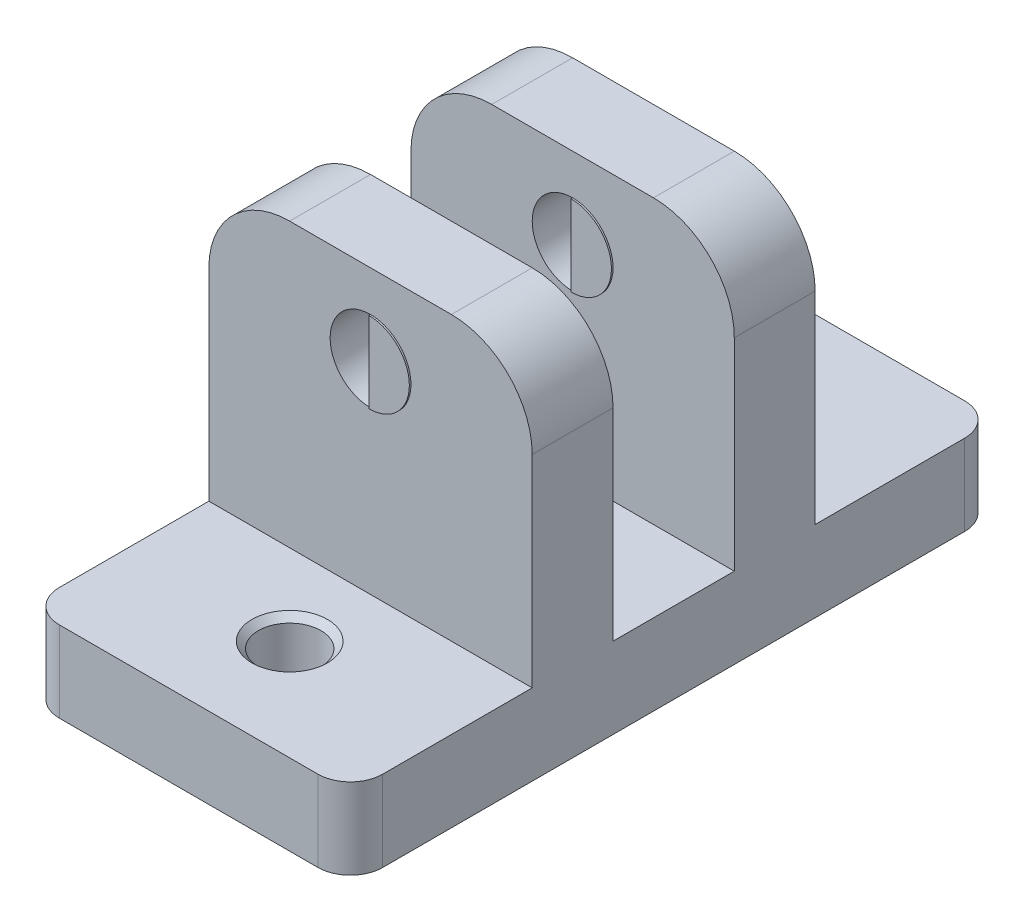
ISO-10303-21;
HEADER;
FILE_DESCRIPTION(('STEP AP214'),'2;1');
FILE_NAME('part.step','',(''),(''),'','','');
FILE_SCHEMA(('AUTOMOTIVE_DESIGN { 1 0 10303 214 1 1 1 1 }'));
ENDSEC;
DATA;
#1=APPLICATION_CONTEXT('core data for automotive mechanical design processes');
#2=APPLICATION_PROTOCOL_DEFINITION('international standard','automotive_design',2000,#1);
#3=PRODUCT_CONTEXT('',#1,'mechanical');
#4=PRODUCT('Part','Part','',(#3));
#5=PRODUCT_RELATED_PRODUCT_CATEGORY('part','',(#4));
#6=PRODUCT_DEFINITION_FORMATION('','',#4);
#7=PRODUCT_DEFINITION_CONTEXT('part definition',#1,'design');
#8=PRODUCT_DEFINITION('design','',#6,#7);
#9=PRODUCT_DEFINITION_SHAPE('','',#8);
#10=(LENGTH_UNIT() NAMED_UNIT(*) SI_UNIT(.MILLI.,.METRE.));
#11=(NAMED_UNIT(*) PLANE_ANGLE_UNIT() SI_UNIT($,.RADIAN.));
#12=(NAMED_UNIT(*) SI_UNIT($,.STERADIAN.) SOLID_ANGLE_UNIT());
#13=UNCERTAINTY_MEASURE_WITH_UNIT(LENGTH_MEASURE(1.E-05),#10,'distance_accuracy_value','');
#14=(GEOMETRIC_REPRESENTATION_CONTEXT(3) GLOBAL_UNCERTAINTY_ASSIGNED_CONTEXT((#13)) GLOBAL_UNIT_ASSIGNED_CONTEXT((#10,
#11,#12)) REPRESENTATION_CONTEXT('',''));
#15=CARTESIAN_POINT('',(0.,0.,0.));
#16=DIRECTION('',(0.,0.,1.));
#17=DIRECTION('',(1.,0.,0.));
#18=AXIS2_PLACEMENT_3D('',#15,#16,#17);
#19=CARTESIAN_POINT('',(0.,22.225,25.4));
#20=DIRECTION('',(0.,0.,-1.));
#21=DIRECTION('',(0.,1.,0.));
#22=AXIS2_PLACEMENT_3D('',#19,#20,#21);
#23=CYLINDRICAL_SURFACE('',#22,3.175);
#24=DIRECTION('',(0.,0.,-1.));
#25=VECTOR('',#24,1.);
#26=CARTESIAN_POINT('',(0.,19.05,25.4));
#27=LINE('',#26,#25);
#28=CARTESIAN_POINT('',(0.,19.05,4.7625));
#29=VERTEX_POINT('',#28);
#30=CARTESIAN_POINT('',(0.,19.05,11.1125));
#31=VERTEX_POINT('',#30);
#32=EDGE_CURVE('E12',#29,#31,#27,.F.);
#33=ORIENTED_EDGE('',*,*,#32,.F.);
#34=CARTESIAN_POINT('',(0.,22.225,4.7625));
#35=DIRECTION('',(0.,0.,1.));
#36=DIRECTION('',(0.,-1.,0.));
#37=AXIS2_PLACEMENT_3D('',#34,#35,#36);
#38=CIRCLE('',#37,3.175);
#39=CARTESIAN_POINT('',(0.,25.4,4.7625));
#40=VERTEX_POINT('',#39);
#41=EDGE_CURVE('E304',#40,#29,#38,.T.);
#42=ORIENTED_EDGE('',*,*,#41,.F.);
#43=DIRECTION('',(0.,0.,-1.));
#44=VECTOR('',#43,1.);
#45=CARTESIAN_POINT('',(0.,25.4,25.4));
#46=LINE('',#45,#44);
#47=CARTESIAN_POINT('',(0.,25.4,11.1125));
#48=VERTEX_POINT('',#47);
#49=EDGE_CURVE('E58',#48,#40,#46,.T.);
#50=ORIENTED_EDGE('',*,*,#49,.F.);
#51=CARTESIAN_POINT('',(0.,22.225,11.1125));
#52=DIRECTION('',(0.,0.,-1.));
#53=DIRECTION('',(0.,1.,0.));
#54=AXIS2_PLACEMENT_3D('',#51,#52,#53);
#55=CIRCLE('',#54,3.175);
#56=EDGE_CURVE('E65',#31,#48,#55,.T.);
#57=ORIENTED_EDGE('',*,*,#56,.F.);
#58=EDGE_LOOP('',(#33,#42,#50,#57));
#59=FACE_BOUND('',#58,.T.);
#60=ADVANCED_FACE('F50',(#59),#23,.F.);
#61=CARTESIAN_POINT('',(0.,28.575,0.));
#62=DIRECTION('',(0.,-1.,0.));
#63=DIRECTION('',(0.,0.,-1.));
#64=AXIS2_PLACEMENT_3D('',#61,#62,#63);
#65=PLANE('',#64);
#66=DIRECTION('',(1.,0.,0.));
#67=VECTOR('',#66,1.);
#68=CARTESIAN_POINT('',(-12.7,28.575,11.1125));
#69=LINE('',#68,#67);
#70=CARTESIAN_POINT('',(-6.35,28.575,11.1125));
#71=VERTEX_POINT('',#70);
#72=CARTESIAN_POINT('',(6.35,28.575,11.1125));
#73=VERTEX_POINT('',#72);
#74=EDGE_CURVE('E360',#71,#73,#69,.T.);
#75=ORIENTED_EDGE('',*,*,#74,.T.);
#76=DIRECTION('',(0.,0.,-1.));
#77=VECTOR('',#76,1.);
#78=CARTESIAN_POINT('',(6.35,28.575,0.));
#79=LINE('',#78,#77);
#80=CARTESIAN_POINT('',(6.35,28.575,4.7625));
#81=VERTEX_POINT('',#80);
#82=EDGE_CURVE('E388',#73,#81,#79,.T.);
#83=ORIENTED_EDGE('',*,*,#82,.T.);
#84=DIRECTION('',(1.,0.,0.));
#85=VECTOR('',#84,1.);
#86=CARTESIAN_POINT('',(-12.7,28.575,4.7625));
#87=LINE('',#86,#85);
#88=CARTESIAN_POINT('',(-6.35,28.575,4.7625));
#89=VERTEX_POINT('',#88);
#90=EDGE_CURVE('E318',#89,#81,#87,.T.);
#91=ORIENTED_EDGE('',*,*,#90,.F.);
#92=DIRECTION('',(0.,0.,1.));
#93=VECTOR('',#92,1.);
#94=CARTESIAN_POINT('',(-6.35,28.575,0.));
#95=LINE('',#94,#93);
#96=EDGE_CURVE('E385',#89,#71,#95,.T.);
#97=ORIENTED_EDGE('',*,*,#96,.T.);
#98=EDGE_LOOP('',(#75,#83,#91,#97));
#99=FACE_BOUND('',#98,.T.);
#100=ADVANCED_FACE('F596',(#99),#65,.F.);
#101=CARTESIAN_POINT('',(12.7,28.575,25.4));
#102=DIRECTION('',(-1.,0.,0.));
#103=DIRECTION('',(0.,0.,1.));
#104=AXIS2_PLACEMENT_3D('',#101,#102,#103);
#105=PLANE('',#104);
#106=DIRECTION('',(0.,0.,-1.));
#107=VECTOR('',#106,1.);
#108=CARTESIAN_POINT('',(12.7,6.35,25.4));
#109=LINE('',#108,#107);
#110=CARTESIAN_POINT('',(12.7,6.35,22.86));
#111=VERTEX_POINT('',#110);
#112=CARTESIAN_POINT('',(12.7,6.35,11.1125));
#113=VERTEX_POINT('',#112);
#114=EDGE_CURVE('E324',#111,#113,#109,.T.);
#115=ORIENTED_EDGE('',*,*,#114,.F.);
#116=DIRECTION('',(0.,-1.,0.));
#117=VECTOR('',#116,1.);
#118=CARTESIAN_POINT('',(12.7,28.575,22.86));
#119=LINE('',#118,#117);
#120=CARTESIAN_POINT('',(12.7,0.,22.86));
#121=VERTEX_POINT('',#120);
#122=EDGE_CURVE('E425',#111,#121,#119,.T.);
#123=ORIENTED_EDGE('',*,*,#122,.T.);
#124=DIRECTION('',(0.,0.,-1.));
#125=VECTOR('',#124,1.);
#126=CARTESIAN_POINT('',(12.7,0.,25.4));
#127=LINE('',#126,#125);
#128=CARTESIAN_POINT('',(12.7,0.,-22.86));
#129=VERTEX_POINT('',#128);
#130=EDGE_CURVE('E363',#121,#129,#127,.T.);
#131=ORIENTED_EDGE('',*,*,#130,.T.);
#132=DIRECTION('',(0.,-1.,0.));
#133=VECTOR('',#132,1.);
#134=CARTESIAN_POINT('',(12.7,28.575,-22.86));
#135=LINE('',#134,#133);
#136=CARTESIAN_POINT('',(12.7,6.35,-22.86));
#137=VERTEX_POINT('',#136);
#138=EDGE_CURVE('E423',#129,#137,#135,.F.);
#139=ORIENTED_EDGE('',*,*,#138,.T.);
#140=DIRECTION('',(0.,0.,-1.));
#141=VECTOR('',#140,1.);
#142=CARTESIAN_POINT('',(12.7,6.35,-25.4));
#143=LINE('',#142,#141);
#144=CARTESIAN_POINT('',(12.7,6.35,-11.1125));
#145=VERTEX_POINT('',#144);
#146=EDGE_CURVE('E312',#145,#137,#143,.T.);
#147=ORIENTED_EDGE('',*,*,#146,.F.);
#148=DIRECTION('',(0.,-1.,0.));
#149=VECTOR('',#148,1.);
#150=CARTESIAN_POINT('',(12.7,28.575,-11.1125));
#151=LINE('',#150,#149);
#152=CARTESIAN_POINT('',(12.7,22.225,-11.1125));
#153=VERTEX_POINT('',#152);
#154=EDGE_CURVE('E316',#153,#145,#151,.T.);
#155=ORIENTED_EDGE('',*,*,#154,.F.);
#156=DIRECTION('',(0.,0.,-1.));
#157=VECTOR('',#156,1.);
#158=CARTESIAN_POINT('',(12.7,22.225,25.4));
#159=LINE('',#158,#157);
#160=CARTESIAN_POINT('',(12.7,22.225,-4.7625));
#161=VERTEX_POINT('',#160);
#162=EDGE_CURVE('E395',#153,#161,#159,.F.);
#163=ORIENTED_EDGE('',*,*,#162,.T.);
#164=DIRECTION('',(0.,1.,0.));
#165=VECTOR('',#164,1.);
#166=CARTESIAN_POINT('',(12.7,28.575,-4.7625));
#167=LINE('',#166,#165);
#168=CARTESIAN_POINT('',(12.7,6.35,-4.7625));
#169=VERTEX_POINT('',#168);
#170=EDGE_CURVE('E522',#169,#161,#167,.T.);
#171=ORIENTED_EDGE('',*,*,#170,.F.);
#172=DIRECTION('',(0.,0.,-1.));
#173=VECTOR('',#172,1.);
#174=CARTESIAN_POINT('',(12.7,6.35,4.76249999999999));
#175=LINE('',#174,#173);
#176=CARTESIAN_POINT('',(12.7,6.35,4.76249999999999));
#177=VERTEX_POINT('',#176);
#178=EDGE_CURVE('E526',#177,#169,#175,.T.);
#179=ORIENTED_EDGE('',*,*,#178,.F.);
#180=DIRECTION('',(0.,-1.,0.));
#181=VECTOR('',#180,1.);
#182=CARTESIAN_POINT('',(12.7,28.575,4.7625));
#183=LINE('',#182,#181);
#184=CARTESIAN_POINT('',(12.7,22.225,4.7625));
#185=VERTEX_POINT('',#184);
#186=EDGE_CURVE('E308',#185,#177,#183,.T.);
#187=ORIENTED_EDGE('',*,*,#186,.F.);
#188=DIRECTION('',(0.,0.,-1.));
#189=VECTOR('',#188,1.);
#190=CARTESIAN_POINT('',(12.7,22.225,25.4));
#191=LINE('',#190,#189);
#192=CARTESIAN_POINT('',(12.7,22.225,11.1125));
#193=VERTEX_POINT('',#192);
#194=EDGE_CURVE('E397',#185,#193,#191,.F.);
#195=ORIENTED_EDGE('',*,*,#194,.T.);
#196=DIRECTION('',(0.,1.,0.));
#197=VECTOR('',#196,1.);
#198=CARTESIAN_POINT('',(12.7,28.575,11.1125));
#199=LINE('',#198,#197);
#200=EDGE_CURVE('E352',#113,#193,#199,.T.);
#201=ORIENTED_EDGE('',*,*,#200,.F.);
#202=EDGE_LOOP('',(#115,#123,#131,#139,#147,#155,#163,#171,#179,#187,#195,#201));
#203=FACE_BOUND('',#202,.T.);
#204=ADVANCED_FACE('F601',(#203),#105,.F.);
#205=CARTESIAN_POINT('',(-12.7,28.575,-25.4));
#206=DIRECTION('',(0.,0.,1.));
#207=DIRECTION('',(1.,0.,0.));
#208=AXIS2_PLACEMENT_3D('',#205,#206,#207);
#209=PLANE('',#208);
#210=DIRECTION('',(1.,0.,0.));
#211=VECTOR('',#210,1.);
#212=CARTESIAN_POINT('',(-12.7,6.35,-25.4));
#213=LINE('',#212,#211);
#214=CARTESIAN_POINT('',(-10.16,6.35,-25.4));
#215=VERTEX_POINT('',#214);
#216=CARTESIAN_POINT('',(10.16,6.35,-25.4));
#217=VERTEX_POINT('',#216);
#218=EDGE_CURVE('E321',#215,#217,#213,.T.);
#219=ORIENTED_EDGE('',*,*,#218,.T.);
#220=DIRECTION('',(0.,-1.,0.));
#221=VECTOR('',#220,1.);
#222=CARTESIAN_POINT('',(10.16,28.575,-25.4));
#223=LINE('',#222,#221);
#224=CARTESIAN_POINT('',(10.16,0.,-25.4));
#225=VERTEX_POINT('',#224);
#226=EDGE_CURVE('E450',#217,#225,#223,.T.);
#227=ORIENTED_EDGE('',*,*,#226,.T.);
#228=DIRECTION('',(-1.,0.,0.));
#229=VECTOR('',#228,1.);
#230=CARTESIAN_POINT('',(-12.7,0.,-25.4));
#231=LINE('',#230,#229);
#232=CARTESIAN_POINT('',(-10.16,0.,-25.4));
#233=VERTEX_POINT('',#232);
#234=EDGE_CURVE('E374',#225,#233,#231,.T.);
#235=ORIENTED_EDGE('',*,*,#234,.T.);
#236=DIRECTION('',(0.,-1.,0.));
#237=VECTOR('',#236,1.);
#238=CARTESIAN_POINT('',(-10.16,28.575,-25.4));
#239=LINE('',#238,#237);
#240=EDGE_CURVE('E448',#233,#215,#239,.F.);
#241=ORIENTED_EDGE('',*,*,#240,.T.);
#242=EDGE_LOOP('',(#219,#227,#235,#241));
#243=FACE_BOUND('',#242,.T.);
#244=ADVANCED_FACE('F653',(#243),#209,.F.);
#245=CARTESIAN_POINT('',(-12.7,28.575,25.4));
#246=DIRECTION('',(1.,0.,0.));
#247=DIRECTION('',(0.,0.,-1.));
#248=AXIS2_PLACEMENT_3D('',#245,#246,#247);
#249=PLANE('',#248);
#250=DIRECTION('',(0.,0.,1.));
#251=VECTOR('',#250,1.);
#252=CARTESIAN_POINT('',(-12.7,0.,25.4));
#253=LINE('',#252,#251);
#254=CARTESIAN_POINT('',(-12.7,0.,-22.86));
#255=VERTEX_POINT('',#254);
#256=CARTESIAN_POINT('',(-12.7,0.,22.86));
#257=VERTEX_POINT('',#256);
#258=EDGE_CURVE('E377',#255,#257,#253,.T.);
#259=ORIENTED_EDGE('',*,*,#258,.T.);
#260=DIRECTION('',(0.,-1.,0.));
#261=VECTOR('',#260,1.);
#262=CARTESIAN_POINT('',(-12.7,28.575,22.86));
#263=LINE('',#262,#261);
#264=CARTESIAN_POINT('',(-12.7,6.35,22.86));
#265=VERTEX_POINT('',#264);
#266=EDGE_CURVE('E460',#257,#265,#263,.F.);
#267=ORIENTED_EDGE('',*,*,#266,.T.);
#268=DIRECTION('',(0.,0.,-1.));
#269=VECTOR('',#268,1.);
#270=CARTESIAN_POINT('',(-12.7,6.35,25.4));
#271=LINE('',#270,#269);
#272=CARTESIAN_POINT('',(-12.7,6.35,11.1125));
#273=VERTEX_POINT('',#272);
#274=EDGE_CURVE('E348',#265,#273,#271,.T.);
#275=ORIENTED_EDGE('',*,*,#274,.T.);
#276=DIRECTION('',(0.,1.,0.));
#277=VECTOR('',#276,1.);
#278=CARTESIAN_POINT('',(-12.7,28.575,11.1125));
#279=LINE('',#278,#277);
#280=CARTESIAN_POINT('',(-12.7,22.225,11.1125));
#281=VERTEX_POINT('',#280);
#282=EDGE_CURVE('E351',#273,#281,#279,.T.);
#283=ORIENTED_EDGE('',*,*,#282,.T.);
#284=DIRECTION('',(0.,0.,1.));
#285=VECTOR('',#284,1.);
#286=CARTESIAN_POINT('',(-12.7,22.225,25.4));
#287=LINE('',#286,#285);
#288=CARTESIAN_POINT('',(-12.7,22.225,4.7625));
#289=VERTEX_POINT('',#288);
#290=EDGE_CURVE('E419',#281,#289,#287,.F.);
#291=ORIENTED_EDGE('',*,*,#290,.T.);
#292=DIRECTION('',(0.,-1.,0.));
#293=VECTOR('',#292,1.);
#294=CARTESIAN_POINT('',(-12.7,28.575,4.7625));
#295=LINE('',#294,#293);
#296=CARTESIAN_POINT('',(-12.7,6.35,4.76249999999999));
#297=VERTEX_POINT('',#296);
#298=EDGE_CURVE('E525',#289,#297,#295,.T.);
#299=ORIENTED_EDGE('',*,*,#298,.T.);
#300=DIRECTION('',(0.,0.,-1.));
#301=VECTOR('',#300,1.);
#302=CARTESIAN_POINT('',(-12.7,6.35,4.76249999999999));
#303=LINE('',#302,#301);
#304=CARTESIAN_POINT('',(-12.7,6.35,-4.7625));
#305=VERTEX_POINT('',#304);
#306=EDGE_CURVE('E533',#297,#305,#303,.T.);
#307=ORIENTED_EDGE('',*,*,#306,.T.);
#308=DIRECTION('',(0.,1.,0.));
#309=VECTOR('',#308,1.);
#310=CARTESIAN_POINT('',(-12.7,28.575,-4.7625));
#311=LINE('',#310,#309);
#312=CARTESIAN_POINT('',(-12.7,22.225,-4.7625));
#313=VERTEX_POINT('',#312);
#314=EDGE_CURVE('E347',#305,#313,#311,.T.);
#315=ORIENTED_EDGE('',*,*,#314,.T.);
#316=DIRECTION('',(0.,0.,1.));
#317=VECTOR('',#316,1.);
#318=CARTESIAN_POINT('',(-12.7,22.225,25.4));
#319=LINE('',#318,#317);
#320=CARTESIAN_POINT('',(-12.7,22.225,-11.1125));
#321=VERTEX_POINT('',#320);
#322=EDGE_CURVE('E421',#313,#321,#319,.F.);
#323=ORIENTED_EDGE('',*,*,#322,.T.);
#324=DIRECTION('',(0.,-1.,0.));
#325=VECTOR('',#324,1.);
#326=CARTESIAN_POINT('',(-12.7,28.575,-11.1125));
#327=LINE('',#326,#325);
#328=CARTESIAN_POINT('',(-12.7,6.35,-11.1125));
#329=VERTEX_POINT('',#328);
#330=EDGE_CURVE('E309',#321,#329,#327,.T.);
#331=ORIENTED_EDGE('',*,*,#330,.T.);
#332=DIRECTION('',(0.,0.,-1.));
#333=VECTOR('',#332,1.);
#334=CARTESIAN_POINT('',(-12.7,6.35,-25.4));
#335=LINE('',#334,#333);
#336=CARTESIAN_POINT('',(-12.7,6.35,-22.86));
#337=VERTEX_POINT('',#336);
#338=EDGE_CURVE('E311',#329,#337,#335,.T.);
#339=ORIENTED_EDGE('',*,*,#338,.T.);
#340=DIRECTION('',(0.,-1.,0.));
#341=VECTOR('',#340,1.);
#342=CARTESIAN_POINT('',(-12.7,28.575,-22.86));
#343=LINE('',#342,#341);
#344=EDGE_CURVE('E457',#337,#255,#343,.T.);
#345=ORIENTED_EDGE('',*,*,#344,.T.);
#346=EDGE_LOOP('',(#259,#267,#275,#283,#291,#299,#307,#315,#323,#331,#339,#345));
#347=FACE_BOUND('',#346,.T.);
#348=ADVANCED_FACE('F538',(#347),#249,.F.);
#349=CARTESIAN_POINT('',(-12.7,28.575,25.4));
#350=DIRECTION('',(0.,0.,-1.));
#351=DIRECTION('',(-1.,0.,0.));
#352=AXIS2_PLACEMENT_3D('',#349,#350,#351);
#353=PLANE('',#352);
#354=DIRECTION('',(1.,0.,0.));
#355=VECTOR('',#354,1.);
#356=CARTESIAN_POINT('',(-12.7,0.,25.4));
#357=LINE('',#356,#355);
#358=CARTESIAN_POINT('',(-10.16,0.,25.4));
#359=VERTEX_POINT('',#358);
#360=CARTESIAN_POINT('',(10.16,0.,25.4));
#361=VERTEX_POINT('',#360);
#362=EDGE_CURVE('E380',#359,#361,#357,.T.);
#363=ORIENTED_EDGE('',*,*,#362,.T.);
#364=DIRECTION('',(0.,-1.,0.));
#365=VECTOR('',#364,1.);
#366=CARTESIAN_POINT('',(10.16,28.575,25.4));
#367=LINE('',#366,#365);
#368=CARTESIAN_POINT('',(10.16,6.35,25.4));
#369=VERTEX_POINT('',#368);
#370=EDGE_CURVE('E441',#361,#369,#367,.F.);
#371=ORIENTED_EDGE('',*,*,#370,.T.);
#372=DIRECTION('',(1.,0.,0.));
#373=VECTOR('',#372,1.);
#374=CARTESIAN_POINT('',(-12.7,6.35,25.4));
#375=LINE('',#374,#373);
#376=CARTESIAN_POINT('',(-10.16,6.35,25.4));
#377=VERTEX_POINT('',#376);
#378=EDGE_CURVE('E356',#377,#369,#375,.T.);
#379=ORIENTED_EDGE('',*,*,#378,.F.);
#380=DIRECTION('',(0.,-1.,0.));
#381=VECTOR('',#380,1.);
#382=CARTESIAN_POINT('',(-10.16,28.575,25.4));
#383=LINE('',#382,#381);
#384=EDGE_CURVE('E437',#377,#359,#383,.T.);
#385=ORIENTED_EDGE('',*,*,#384,.T.);
#386=EDGE_LOOP('',(#363,#371,#379,#385));
#387=FACE_BOUND('',#386,.T.);
#388=ADVANCED_FACE('F644',(#387),#353,.F.);
#389=DIRECTION('',(1.,0.,0.));
#390=VECTOR('',#389,1.);
#391=CARTESIAN_POINT('',(-12.7,28.575,-4.7625));
#392=LINE('',#391,#390);
#393=CARTESIAN_POINT('',(-6.35,28.575,-4.7625));
#394=VERTEX_POINT('',#393);
#395=CARTESIAN_POINT('',(6.35,28.575,-4.7625));
#396=VERTEX_POINT('',#395);
#397=EDGE_CURVE('E340',#394,#396,#392,.T.);
#398=ORIENTED_EDGE('',*,*,#397,.T.);
#399=DIRECTION('',(0.,0.,-1.));
#400=VECTOR('',#399,1.);
#401=CARTESIAN_POINT('',(6.35,28.575,0.));
#402=LINE('',#401,#400);
#403=CARTESIAN_POINT('',(6.35,28.575,-11.1125));
#404=VERTEX_POINT('',#403);
#405=EDGE_CURVE('E407',#396,#404,#402,.T.);
#406=ORIENTED_EDGE('',*,*,#405,.T.);
#407=DIRECTION('',(1.,0.,0.));
#408=VECTOR('',#407,1.);
#409=CARTESIAN_POINT('',(-12.7,28.575,-11.1125));
#410=LINE('',#409,#408);
#411=CARTESIAN_POINT('',(-6.35,28.575,-11.1125));
#412=VERTEX_POINT('',#411);
#413=EDGE_CURVE('E315',#412,#404,#410,.T.);
#414=ORIENTED_EDGE('',*,*,#413,.F.);
#415=DIRECTION('',(0.,0.,1.));
#416=VECTOR('',#415,1.);
#417=CARTESIAN_POINT('',(-6.35,28.575,0.));
#418=LINE('',#417,#416);
#419=EDGE_CURVE('E404',#412,#394,#418,.T.);
#420=ORIENTED_EDGE('',*,*,#419,.T.);
#421=EDGE_LOOP('',(#398,#406,#414,#420));
#422=FACE_BOUND('',#421,.T.);
#423=ADVANCED_FACE('F560',(#422),#65,.F.);
#424=CARTESIAN_POINT('',(0.,0.,0.));
#425=DIRECTION('',(0.,-1.,0.));
#426=DIRECTION('',(0.,0.,-1.));
#427=AXIS2_PLACEMENT_3D('',#424,#425,#426);
#428=PLANE('',#427);
#429=CARTESIAN_POINT('',(0.,0.,-17.4625));
#430=DIRECTION('',(0.,-1.,0.));
#431=DIRECTION('',(0.,0.,-1.));
#432=AXIS2_PLACEMENT_3D('',#429,#430,#431);
#433=CIRCLE('',#432,2.96545000000001);
#434=CARTESIAN_POINT('',(0.,0.,-20.42795));
#435=VERTEX_POINT('',#434);
#436=EDGE_CURVE('E476',#435,#435,#433,.F.);
#437=ORIENTED_EDGE('',*,*,#436,.T.);
#438=EDGE_LOOP('',(#437));
#439=FACE_BOUND('',#438,.T.);
#440=CARTESIAN_POINT('',(0.,0.,17.4625));
#441=DIRECTION('',(0.,-1.,0.));
#442=DIRECTION('',(0.,0.,-1.));
#443=AXIS2_PLACEMENT_3D('',#440,#441,#442);
#444=CIRCLE('',#443,2.96544999999999);
#445=CARTESIAN_POINT('',(0.,0.,14.49705));
#446=VERTEX_POINT('',#445);
#447=EDGE_CURVE('E472',#446,#446,#444,.F.);
#448=ORIENTED_EDGE('',*,*,#447,.T.);
#449=EDGE_LOOP('',(#448));
#450=FACE_BOUND('',#449,.T.);
#451=ORIENTED_EDGE('',*,*,#130,.F.);
#452=CARTESIAN_POINT('',(10.16,0.,22.86));
#453=DIRECTION('',(0.,-1.,0.));
#454=DIRECTION('',(0.,0.,-1.));
#455=AXIS2_PLACEMENT_3D('',#452,#453,#454);
#456=CIRCLE('',#455,2.54);
#457=EDGE_CURVE('E435',#121,#361,#456,.T.);
#458=ORIENTED_EDGE('',*,*,#457,.T.);
#459=ORIENTED_EDGE('',*,*,#362,.F.);
#460=CARTESIAN_POINT('',(-10.16,0.,22.86));
#461=DIRECTION('',(0.,-1.,0.));
#462=DIRECTION('',(0.,0.,-1.));
#463=AXIS2_PLACEMENT_3D('',#460,#461,#462);
#464=CIRCLE('',#463,2.54);
#465=EDGE_CURVE('E430',#359,#257,#464,.T.);
#466=ORIENTED_EDGE('',*,*,#465,.T.);
#467=ORIENTED_EDGE('',*,*,#258,.F.);
#468=CARTESIAN_POINT('',(-10.16,0.,-22.86));
#469=DIRECTION('',(0.,-1.,0.));
#470=DIRECTION('',(0.,0.,-1.));
#471=AXIS2_PLACEMENT_3D('',#468,#469,#470);
#472=CIRCLE('',#471,2.54);
#473=EDGE_CURVE('E428',#255,#233,#472,.T.);
#474=ORIENTED_EDGE('',*,*,#473,.T.);
#475=ORIENTED_EDGE('',*,*,#234,.F.);
#476=CARTESIAN_POINT('',(10.16,0.,-22.86));
#477=DIRECTION('',(0.,-1.,0.));
#478=DIRECTION('',(0.,0.,-1.));
#479=AXIS2_PLACEMENT_3D('',#476,#477,#478);
#480=CIRCLE('',#479,2.54);
#481=EDGE_CURVE('E433',#225,#129,#480,.T.);
#482=ORIENTED_EDGE('',*,*,#481,.T.);
#483=EDGE_LOOP('',(#451,#458,#459,#466,#467,#474,#475,#482));
#484=FACE_BOUND('',#483,.T.);
#485=ADVANCED_FACE('F638',(#439,#450,#484),#428,.T.);
#486=CARTESIAN_POINT('',(-12.7,28.575,11.1125));
#487=DIRECTION('',(0.,0.,-1.));
#488=DIRECTION('',(0.,1.,0.));
#489=AXIS2_PLACEMENT_3D('',#486,#487,#488);
#490=PLANE('',#489);
#491=EDGE_CURVE('E247',#48,#31,#55,.T.);
#492=ORIENTED_EDGE('',*,*,#491,.T.);
#493=ORIENTED_EDGE('',*,*,#56,.T.);
#494=EDGE_LOOP('',(#492,#493));
#495=FACE_BOUND('',#494,.T.);
#496=ORIENTED_EDGE('',*,*,#200,.T.);
#497=CARTESIAN_POINT('',(6.35,22.225,11.1125));
#498=DIRECTION('',(0.,0.,-1.));
#499=DIRECTION('',(0.,1.,0.));
#500=AXIS2_PLACEMENT_3D('',#497,#498,#499);
#501=CIRCLE('',#500,6.35);
#502=EDGE_CURVE('E401',#193,#73,#501,.F.);
#503=ORIENTED_EDGE('',*,*,#502,.T.);
#504=ORIENTED_EDGE('',*,*,#74,.F.);
#505=CARTESIAN_POINT('',(-6.35,22.225,11.1125));
#506=DIRECTION('',(0.,0.,-1.));
#507=DIRECTION('',(0.,1.,0.));
#508=AXIS2_PLACEMENT_3D('',#505,#506,#507);
#509=CIRCLE('',#508,6.35);
#510=EDGE_CURVE('E399',#71,#281,#509,.F.);
#511=ORIENTED_EDGE('',*,*,#510,.T.);
#512=ORIENTED_EDGE('',*,*,#282,.F.);
#513=DIRECTION('',(1.,0.,0.));
#514=VECTOR('',#513,1.);
#515=CARTESIAN_POINT('',(-12.7,6.35,11.1125));
#516=LINE('',#515,#514);
#517=EDGE_CURVE('E364',#273,#113,#516,.T.);
#518=ORIENTED_EDGE('',*,*,#517,.T.);
#519=EDGE_LOOP('',(#496,#503,#504,#511,#512,#518));
#520=FACE_BOUND('',#519,.T.);
#521=ADVANCED_FACE('F635',(#495,#520),#490,.F.);
#522=CARTESIAN_POINT('',(-12.7,6.35,25.4));
#523=DIRECTION('',(0.,-1.,0.));
#524=DIRECTION('',(0.,0.,-1.));
#525=AXIS2_PLACEMENT_3D('',#522,#523,#524);
#526=PLANE('',#525);
#527=CARTESIAN_POINT('',(0.,6.35,17.4625));
#528=DIRECTION('',(0.,-1.,0.));
#529=DIRECTION('',(0.,0.,-1.));
#530=AXIS2_PLACEMENT_3D('',#527,#528,#529);
#531=CIRCLE('',#530,2.96545000000001);
#532=CARTESIAN_POINT('',(0.,6.35,14.49705));
#533=VERTEX_POINT('',#532);
#534=EDGE_CURVE('E487',#533,#533,#531,.T.);
#535=ORIENTED_EDGE('',*,*,#534,.T.);
#536=EDGE_LOOP('',(#535));
#537=FACE_BOUND('',#536,.T.);
#538=ORIENTED_EDGE('',*,*,#378,.T.);
#539=CARTESIAN_POINT('',(10.16,6.35,22.86));
#540=DIRECTION('',(0.,-1.,0.));
#541=DIRECTION('',(0.,0.,-1.));
#542=AXIS2_PLACEMENT_3D('',#539,#540,#541);
#543=CIRCLE('',#542,2.54);
#544=EDGE_CURVE('E446',#369,#111,#543,.F.);
#545=ORIENTED_EDGE('',*,*,#544,.T.);
#546=ORIENTED_EDGE('',*,*,#114,.T.);
#547=ORIENTED_EDGE('',*,*,#517,.F.);
#548=ORIENTED_EDGE('',*,*,#274,.F.);
#549=CARTESIAN_POINT('',(-10.16,6.35,22.86));
#550=DIRECTION('',(0.,-1.,0.));
#551=DIRECTION('',(0.,0.,-1.));
#552=AXIS2_PLACEMENT_3D('',#549,#550,#551);
#553=CIRCLE('',#552,2.54);
#554=EDGE_CURVE('E443',#265,#377,#553,.F.);
#555=ORIENTED_EDGE('',*,*,#554,.T.);
#556=EDGE_LOOP('',(#538,#545,#546,#547,#548,#555));
#557=FACE_BOUND('',#556,.T.);
#558=ADVANCED_FACE('F511',(#537,#557),#526,.F.);
#559=CARTESIAN_POINT('',(-12.7,28.575,4.7625));
#560=DIRECTION('',(0.,0.,1.));
#561=DIRECTION('',(0.,-1.,0.));
#562=AXIS2_PLACEMENT_3D('',#559,#560,#561);
#563=PLANE('',#562);
#564=EDGE_CURVE('E305',#29,#40,#38,.T.);
#565=ORIENTED_EDGE('',*,*,#564,.T.);
#566=ORIENTED_EDGE('',*,*,#41,.T.);
#567=EDGE_LOOP('',(#565,#566));
#568=FACE_BOUND('',#567,.T.);
#569=ORIENTED_EDGE('',*,*,#90,.T.);
#570=CARTESIAN_POINT('',(6.35,22.225,4.7625));
#571=DIRECTION('',(0.,0.,1.));
#572=DIRECTION('',(0.,-1.,0.));
#573=AXIS2_PLACEMENT_3D('',#570,#571,#572);
#574=CIRCLE('',#573,6.35);
#575=EDGE_CURVE('E393',#81,#185,#574,.F.);
#576=ORIENTED_EDGE('',*,*,#575,.T.);
#577=ORIENTED_EDGE('',*,*,#186,.T.);
#578=DIRECTION('',(1.,0.,0.));
#579=VECTOR('',#578,1.);
#580=CARTESIAN_POINT('',(-12.7,6.35,4.76249999999999));
#581=LINE('',#580,#579);
#582=EDGE_CURVE('E341',#297,#177,#581,.T.);
#583=ORIENTED_EDGE('',*,*,#582,.F.);
#584=ORIENTED_EDGE('',*,*,#298,.F.);
#585=CARTESIAN_POINT('',(-6.35,22.225,4.7625));
#586=DIRECTION('',(0.,0.,1.));
#587=DIRECTION('',(0.,-1.,0.));
#588=AXIS2_PLACEMENT_3D('',#585,#586,#587);
#589=CIRCLE('',#588,6.35);
#590=EDGE_CURVE('E391',#289,#89,#589,.F.);
#591=ORIENTED_EDGE('',*,*,#590,.T.);
#592=EDGE_LOOP('',(#569,#576,#577,#583,#584,#591));
#593=FACE_BOUND('',#592,.T.);
#594=ADVANCED_FACE('F507',(#568,#593),#563,.F.);
#595=CARTESIAN_POINT('',(-12.7,28.575,-4.7625));
#596=DIRECTION('',(0.,0.,-1.));
#597=DIRECTION('',(0.,1.,0.));
#598=AXIS2_PLACEMENT_3D('',#595,#596,#597);
#599=PLANE('',#598);
#600=CARTESIAN_POINT('',(0.,22.225,-4.7625));
#601=DIRECTION('',(0.,0.,-1.));
#602=DIRECTION('',(0.,1.,0.));
#603=AXIS2_PLACEMENT_3D('',#600,#601,#602);
#604=CIRCLE('',#603,3.175);
#605=CARTESIAN_POINT('',(0.,25.4,-4.7625));
#606=VERTEX_POINT('',#605);
#607=CARTESIAN_POINT('',(0.,19.05,-4.7625));
#608=VERTEX_POINT('',#607);
#609=EDGE_CURVE('E300',#606,#608,#604,.T.);
#610=ORIENTED_EDGE('',*,*,#609,.T.);
#611=EDGE_CURVE('E299',#608,#606,#604,.T.);
#612=ORIENTED_EDGE('',*,*,#611,.T.);
#613=EDGE_LOOP('',(#610,#612));
#614=FACE_BOUND('',#613,.T.);
#615=ORIENTED_EDGE('',*,*,#170,.T.);
#616=CARTESIAN_POINT('',(6.35,22.225,-4.7625));
#617=DIRECTION('',(0.,0.,-1.));
#618=DIRECTION('',(0.,1.,0.));
#619=AXIS2_PLACEMENT_3D('',#616,#617,#618);
#620=CIRCLE('',#619,6.35);
#621=EDGE_CURVE('E417',#161,#396,#620,.F.);
#622=ORIENTED_EDGE('',*,*,#621,.T.);
#623=ORIENTED_EDGE('',*,*,#397,.F.);
#624=CARTESIAN_POINT('',(-6.35,22.225,-4.7625));
#625=DIRECTION('',(0.,0.,-1.));
#626=DIRECTION('',(0.,1.,0.));
#627=AXIS2_PLACEMENT_3D('',#624,#625,#626);
#628=CIRCLE('',#627,6.35);
#629=EDGE_CURVE('E415',#394,#313,#628,.F.);
#630=ORIENTED_EDGE('',*,*,#629,.T.);
#631=ORIENTED_EDGE('',*,*,#314,.F.);
#632=DIRECTION('',(1.,0.,0.));
#633=VECTOR('',#632,1.);
#634=CARTESIAN_POINT('',(-12.7,6.35,-4.7625));
#635=LINE('',#634,#633);
#636=EDGE_CURVE('E336',#305,#169,#635,.T.);
#637=ORIENTED_EDGE('',*,*,#636,.T.);
#638=EDGE_LOOP('',(#615,#622,#623,#630,#631,#637));
#639=FACE_BOUND('',#638,.T.);
#640=ADVANCED_FACE('F510',(#614,#639),#599,.F.);
#641=CARTESIAN_POINT('',(-12.7,6.35,4.76249999999999));
#642=DIRECTION('',(0.,-1.,0.));
#643=DIRECTION('',(0.,0.,-1.));
#644=AXIS2_PLACEMENT_3D('',#641,#642,#643);
#645=PLANE('',#644);
#646=ORIENTED_EDGE('',*,*,#178,.T.);
#647=ORIENTED_EDGE('',*,*,#636,.F.);
#648=ORIENTED_EDGE('',*,*,#306,.F.);
#649=ORIENTED_EDGE('',*,*,#582,.T.);
#650=EDGE_LOOP('',(#646,#647,#648,#649));
#651=FACE_BOUND('',#650,.T.);
#652=ADVANCED_FACE('F543',(#651),#645,.F.);
#653=CARTESIAN_POINT('',(-12.7,6.35,-25.4));
#654=DIRECTION('',(0.,-1.,0.));
#655=DIRECTION('',(0.,0.,-1.));
#656=AXIS2_PLACEMENT_3D('',#653,#654,#655);
#657=PLANE('',#656);
#658=CARTESIAN_POINT('',(0.,6.35,-17.4625));
#659=DIRECTION('',(0.,-1.,0.));
#660=DIRECTION('',(0.,0.,-1.));
#661=AXIS2_PLACEMENT_3D('',#658,#659,#660);
#662=CIRCLE('',#661,2.96545000000001);
#663=CARTESIAN_POINT('',(0.,6.35,-20.42795));
#664=VERTEX_POINT('',#663);
#665=EDGE_CURVE('E469',#664,#664,#662,.T.);
#666=ORIENTED_EDGE('',*,*,#665,.T.);
#667=EDGE_LOOP('',(#666));
#668=FACE_BOUND('',#667,.T.);
#669=ORIENTED_EDGE('',*,*,#146,.T.);
#670=CARTESIAN_POINT('',(10.16,6.35,-22.86));
#671=DIRECTION('',(0.,-1.,0.));
#672=DIRECTION('',(0.,0.,-1.));
#673=AXIS2_PLACEMENT_3D('',#670,#671,#672);
#674=CIRCLE('',#673,2.54);
#675=EDGE_CURVE('E455',#137,#217,#674,.F.);
#676=ORIENTED_EDGE('',*,*,#675,.T.);
#677=ORIENTED_EDGE('',*,*,#218,.F.);
#678=CARTESIAN_POINT('',(-10.16,6.35,-22.86));
#679=DIRECTION('',(0.,-1.,0.));
#680=DIRECTION('',(0.,0.,-1.));
#681=AXIS2_PLACEMENT_3D('',#678,#679,#680);
#682=CIRCLE('',#681,2.54);
#683=EDGE_CURVE('E453',#215,#337,#682,.F.);
#684=ORIENTED_EDGE('',*,*,#683,.T.);
#685=ORIENTED_EDGE('',*,*,#338,.F.);
#686=DIRECTION('',(1.,0.,0.));
#687=VECTOR('',#686,1.);
#688=CARTESIAN_POINT('',(-12.7,6.35,-11.1125));
#689=LINE('',#688,#687);
#690=EDGE_CURVE('E325',#329,#145,#689,.T.);
#691=ORIENTED_EDGE('',*,*,#690,.T.);
#692=EDGE_LOOP('',(#669,#676,#677,#684,#685,#691));
#693=FACE_BOUND('',#692,.T.);
#694=ADVANCED_FACE('F624',(#668,#693),#657,.F.);
#695=CARTESIAN_POINT('',(-12.7,28.575,-11.1125));
#696=DIRECTION('',(0.,0.,1.));
#697=DIRECTION('',(0.,-1.,0.));
#698=AXIS2_PLACEMENT_3D('',#695,#696,#697);
#699=PLANE('',#698);
#700=CARTESIAN_POINT('',(0.,22.225,-11.1125));
#701=DIRECTION('',(0.,0.,-1.));
#702=DIRECTION('',(0.,1.,0.));
#703=AXIS2_PLACEMENT_3D('',#700,#701,#702);
#704=CIRCLE('',#703,3.175);
#705=CARTESIAN_POINT('',(0.,25.4,-11.1125));
#706=VERTEX_POINT('',#705);
#707=CARTESIAN_POINT('',(0.,19.05,-11.1125));
#708=VERTEX_POINT('',#707);
#709=EDGE_CURVE('E295',#706,#708,#704,.T.);
#710=ORIENTED_EDGE('',*,*,#709,.F.);
#711=EDGE_CURVE('E290',#708,#706,#704,.T.);
#712=ORIENTED_EDGE('',*,*,#711,.F.);
#713=EDGE_LOOP('',(#710,#712));
#714=FACE_BOUND('',#713,.T.);
#715=ORIENTED_EDGE('',*,*,#413,.T.);
#716=CARTESIAN_POINT('',(6.35,22.225,-11.1125));
#717=DIRECTION('',(0.,0.,1.));
#718=DIRECTION('',(0.,-1.,0.));
#719=AXIS2_PLACEMENT_3D('',#716,#717,#718);
#720=CIRCLE('',#719,6.35);
#721=EDGE_CURVE('E412',#404,#153,#720,.F.);
#722=ORIENTED_EDGE('',*,*,#721,.T.);
#723=ORIENTED_EDGE('',*,*,#154,.T.);
#724=ORIENTED_EDGE('',*,*,#690,.F.);
#725=ORIENTED_EDGE('',*,*,#330,.F.);
#726=CARTESIAN_POINT('',(-6.35,22.225,-11.1125));
#727=DIRECTION('',(0.,0.,1.));
#728=DIRECTION('',(0.,-1.,0.));
#729=AXIS2_PLACEMENT_3D('',#726,#727,#728);
#730=CIRCLE('',#729,6.35);
#731=EDGE_CURVE('E410',#321,#412,#730,.F.);
#732=ORIENTED_EDGE('',*,*,#731,.T.);
#733=EDGE_LOOP('',(#715,#722,#723,#724,#725,#732));
#734=FACE_BOUND('',#733,.T.);
#735=ADVANCED_FACE('F557',(#714,#734),#699,.F.);
#736=CARTESIAN_POINT('',(0.,6.35,-17.4625));
#737=DIRECTION('',(0.,1.,0.));
#738=DIRECTION('',(0.,0.,1.));
#739=AXIS2_PLACEMENT_3D('',#736,#737,#738);
#740=CYLINDRICAL_SURFACE('',#739,2.45745);
#741=CARTESIAN_POINT('',(0.,5.842,-17.4625));
#742=DIRECTION('',(0.,-1.,0.));
#743=DIRECTION('',(0.,0.,-1.));
#744=AXIS2_PLACEMENT_3D('',#741,#742,#743);
#745=CIRCLE('',#744,2.45745);
#746=CARTESIAN_POINT('',(0.,5.842,-19.91995));
#747=VERTEX_POINT('',#746);
#748=EDGE_CURVE('E466',#747,#747,#745,.F.);
#749=ORIENTED_EDGE('',*,*,#748,.T.);
#750=EDGE_LOOP('',(#749));
#751=FACE_BOUND('',#750,.T.);
#752=CARTESIAN_POINT('',(0.,0.508000000000013,-17.4625));
#753=DIRECTION('',(0.,-1.,0.));
#754=DIRECTION('',(0.,0.,-1.));
#755=AXIS2_PLACEMENT_3D('',#752,#753,#754);
#756=CIRCLE('',#755,2.45745);
#757=CARTESIAN_POINT('',(0.,0.508000000000013,-19.91995));
#758=VERTEX_POINT('',#757);
#759=EDGE_CURVE('E463',#758,#758,#756,.T.);
#760=ORIENTED_EDGE('',*,*,#759,.T.);
#761=EDGE_LOOP('',(#760));
#762=FACE_BOUND('',#761,.T.);
#763=ADVANCED_FACE('F615',(#751,#762),#740,.F.);
#764=CARTESIAN_POINT('',(0.,6.34999999999999,17.4625));
#765=DIRECTION('',(0.,1.,0.));
#766=DIRECTION('',(0.,0.,1.));
#767=AXIS2_PLACEMENT_3D('',#764,#765,#766);
#768=CYLINDRICAL_SURFACE('',#767,2.45745);
#769=CARTESIAN_POINT('',(0.,5.84199999999999,17.4625));
#770=DIRECTION('',(0.,-1.,0.));
#771=DIRECTION('',(0.,0.,-1.));
#772=AXIS2_PLACEMENT_3D('',#769,#770,#771);
#773=CIRCLE('',#772,2.45745);
#774=CARTESIAN_POINT('',(0.,5.84199999999999,15.00505));
#775=VERTEX_POINT('',#774);
#776=EDGE_CURVE('E483',#775,#775,#773,.F.);
#777=ORIENTED_EDGE('',*,*,#776,.T.);
#778=EDGE_LOOP('',(#777));
#779=FACE_BOUND('',#778,.T.);
#780=CARTESIAN_POINT('',(0.,0.508000000000002,17.4625));
#781=DIRECTION('',(0.,-1.,0.));
#782=DIRECTION('',(0.,0.,-1.));
#783=AXIS2_PLACEMENT_3D('',#780,#781,#782);
#784=CIRCLE('',#783,2.45745);
#785=CARTESIAN_POINT('',(0.,0.508000000000002,15.00505));
#786=VERTEX_POINT('',#785);
#787=EDGE_CURVE('E479',#786,#786,#784,.T.);
#788=ORIENTED_EDGE('',*,*,#787,.T.);
#789=EDGE_LOOP('',(#788));
#790=FACE_BOUND('',#789,.T.);
#791=ADVANCED_FACE('F607',(#779,#790),#768,.F.);
#792=ORIENTED_EDGE('',*,*,#711,.T.);
#793=DIRECTION('',(0.,0.,-1.));
#794=VECTOR('',#793,1.);
#795=CARTESIAN_POINT('',(0.,25.4,25.4));
#796=LINE('',#795,#794);
#797=EDGE_CURVE('E494',#706,#606,#796,.F.);
#798=ORIENTED_EDGE('',*,*,#797,.T.);
#799=ORIENTED_EDGE('',*,*,#611,.F.);
#800=DIRECTION('',(0.,0.,-1.));
#801=VECTOR('',#800,1.);
#802=CARTESIAN_POINT('',(0.,19.05,25.4));
#803=LINE('',#802,#801);
#804=EDGE_CURVE('E491',#608,#708,#803,.T.);
#805=ORIENTED_EDGE('',*,*,#804,.T.);
#806=EDGE_LOOP('',(#792,#798,#799,#805));
#807=FACE_BOUND('',#806,.T.);
#808=ADVANCED_FACE('F571',(#807),#23,.F.);
#809=CARTESIAN_POINT('',(6.35,22.225,0.));
#810=DIRECTION('',(0.,0.,-1.));
#811=DIRECTION('',(-1.,0.,0.));
#812=AXIS2_PLACEMENT_3D('',#809,#810,#811);
#813=CYLINDRICAL_SURFACE('',#812,6.35);
#814=ORIENTED_EDGE('',*,*,#502,.F.);
#815=ORIENTED_EDGE('',*,*,#194,.F.);
#816=ORIENTED_EDGE('',*,*,#575,.F.);
#817=ORIENTED_EDGE('',*,*,#82,.F.);
#818=EDGE_LOOP('',(#814,#815,#816,#817));
#819=FACE_BOUND('',#818,.T.);
#820=ADVANCED_FACE('F606',(#819),#813,.T.);
#821=CARTESIAN_POINT('',(6.35,22.225,0.));
#822=DIRECTION('',(0.,0.,-1.));
#823=DIRECTION('',(-1.,0.,0.));
#824=AXIS2_PLACEMENT_3D('',#821,#822,#823);
#825=CYLINDRICAL_SURFACE('',#824,6.35);
#826=ORIENTED_EDGE('',*,*,#621,.F.);
#827=ORIENTED_EDGE('',*,*,#162,.F.);
#828=ORIENTED_EDGE('',*,*,#721,.F.);
#829=ORIENTED_EDGE('',*,*,#405,.F.);
#830=EDGE_LOOP('',(#826,#827,#828,#829));
#831=FACE_BOUND('',#830,.T.);
#832=ADVANCED_FACE('F612',(#831),#825,.T.);
#833=CARTESIAN_POINT('',(-6.35,22.225,0.));
#834=DIRECTION('',(0.,0.,1.));
#835=DIRECTION('',(1.,0.,0.));
#836=AXIS2_PLACEMENT_3D('',#833,#834,#835);
#837=CYLINDRICAL_SURFACE('',#836,6.35);
#838=ORIENTED_EDGE('',*,*,#731,.F.);
#839=ORIENTED_EDGE('',*,*,#322,.F.);
#840=ORIENTED_EDGE('',*,*,#629,.F.);
#841=ORIENTED_EDGE('',*,*,#419,.F.);
#842=EDGE_LOOP('',(#838,#839,#840,#841));
#843=FACE_BOUND('',#842,.T.);
#844=ADVANCED_FACE('F552',(#843),#837,.T.);
#845=CARTESIAN_POINT('',(-6.35,22.225,0.));
#846=DIRECTION('',(0.,0.,1.));
#847=DIRECTION('',(1.,0.,0.));
#848=AXIS2_PLACEMENT_3D('',#845,#846,#847);
#849=CYLINDRICAL_SURFACE('',#848,6.35);
#850=ORIENTED_EDGE('',*,*,#590,.F.);
#851=ORIENTED_EDGE('',*,*,#290,.F.);
#852=ORIENTED_EDGE('',*,*,#510,.F.);
#853=ORIENTED_EDGE('',*,*,#96,.F.);
#854=EDGE_LOOP('',(#850,#851,#852,#853));
#855=FACE_BOUND('',#854,.T.);
#856=ADVANCED_FACE('F665',(#855),#849,.T.);
#857=CARTESIAN_POINT('',(10.16,28.575,22.86));
#858=DIRECTION('',(0.,-1.,0.));
#859=DIRECTION('',(0.,0.,-1.));
#860=AXIS2_PLACEMENT_3D('',#857,#858,#859);
#861=CYLINDRICAL_SURFACE('',#860,2.54);
#862=ORIENTED_EDGE('',*,*,#544,.F.);
#863=ORIENTED_EDGE('',*,*,#370,.F.);
#864=ORIENTED_EDGE('',*,*,#457,.F.);
#865=ORIENTED_EDGE('',*,*,#122,.F.);
#866=EDGE_LOOP('',(#862,#863,#864,#865));
#867=FACE_BOUND('',#866,.T.);
#868=ADVANCED_FACE('F668',(#867),#861,.T.);
#869=CARTESIAN_POINT('',(10.16,28.575,-22.86));
#870=DIRECTION('',(0.,-1.,0.));
#871=DIRECTION('',(0.,0.,-1.));
#872=AXIS2_PLACEMENT_3D('',#869,#870,#871);
#873=CYLINDRICAL_SURFACE('',#872,2.54);
#874=ORIENTED_EDGE('',*,*,#675,.F.);
#875=ORIENTED_EDGE('',*,*,#138,.F.);
#876=ORIENTED_EDGE('',*,*,#481,.F.);
#877=ORIENTED_EDGE('',*,*,#226,.F.);
#878=EDGE_LOOP('',(#874,#875,#876,#877));
#879=FACE_BOUND('',#878,.T.);
#880=ADVANCED_FACE('F672',(#879),#873,.T.);
#881=CARTESIAN_POINT('',(-10.16,28.575,22.86));
#882=DIRECTION('',(0.,-1.,0.));
#883=DIRECTION('',(0.,0.,-1.));
#884=AXIS2_PLACEMENT_3D('',#881,#882,#883);
#885=CYLINDRICAL_SURFACE('',#884,2.54);
#886=ORIENTED_EDGE('',*,*,#554,.F.);
#887=ORIENTED_EDGE('',*,*,#266,.F.);
#888=ORIENTED_EDGE('',*,*,#465,.F.);
#889=ORIENTED_EDGE('',*,*,#384,.F.);
#890=EDGE_LOOP('',(#886,#887,#888,#889));
#891=FACE_BOUND('',#890,.T.);
#892=ADVANCED_FACE('F676',(#891),#885,.T.);
#893=CARTESIAN_POINT('',(-10.16,28.575,-22.86));
#894=DIRECTION('',(0.,-1.,0.));
#895=DIRECTION('',(0.,0.,-1.));
#896=AXIS2_PLACEMENT_3D('',#893,#894,#895);
#897=CYLINDRICAL_SURFACE('',#896,2.54);
#898=ORIENTED_EDGE('',*,*,#683,.F.);
#899=ORIENTED_EDGE('',*,*,#240,.F.);
#900=ORIENTED_EDGE('',*,*,#473,.F.);
#901=ORIENTED_EDGE('',*,*,#344,.F.);
#902=EDGE_LOOP('',(#898,#899,#900,#901));
#903=FACE_BOUND('',#902,.T.);
#904=ADVANCED_FACE('F680',(#903),#897,.T.);
#905=CARTESIAN_POINT('',(0.,5.842,-17.4625));
#906=DIRECTION('',(0.,1.,0.));
#907=DIRECTION('',(0.,0.,1.));
#908=AXIS2_PLACEMENT_3D('',#905,#906,#907);
#909=CONICAL_SURFACE('',#908,2.45745,0.785398163397455);
#910=ORIENTED_EDGE('',*,*,#665,.F.);
#911=EDGE_LOOP('',(#910));
#912=FACE_BOUND('',#911,.T.);
#913=ORIENTED_EDGE('',*,*,#748,.F.);
#914=EDGE_LOOP('',(#913));
#915=FACE_BOUND('',#914,.T.);
#916=ADVANCED_FACE('F684',(#912,#915),#909,.F.);
#917=CARTESIAN_POINT('',(0.,0.,-17.4625));
#918=DIRECTION('',(0.,-1.,0.));
#919=DIRECTION('',(0.,0.,-1.));
#920=AXIS2_PLACEMENT_3D('',#917,#918,#919);
#921=CONICAL_SURFACE('',#920,2.96545000000001,0.785398163397445);
#922=ORIENTED_EDGE('',*,*,#759,.F.);
#923=EDGE_LOOP('',(#922));
#924=FACE_BOUND('',#923,.T.);
#925=ORIENTED_EDGE('',*,*,#436,.F.);
#926=EDGE_LOOP('',(#925));
#927=FACE_BOUND('',#926,.T.);
#928=ADVANCED_FACE('F688',(#924,#927),#921,.F.);
#929=CARTESIAN_POINT('',(0.,5.84199999999999,17.4625));
#930=DIRECTION('',(0.,1.,0.));
#931=DIRECTION('',(0.,0.,1.));
#932=AXIS2_PLACEMENT_3D('',#929,#930,#931);
#933=CONICAL_SURFACE('',#932,2.45745,0.785398163397455);
#934=ORIENTED_EDGE('',*,*,#534,.F.);
#935=EDGE_LOOP('',(#934));
#936=FACE_BOUND('',#935,.T.);
#937=ORIENTED_EDGE('',*,*,#776,.F.);
#938=EDGE_LOOP('',(#937));
#939=FACE_BOUND('',#938,.T.);
#940=ADVANCED_FACE('F691',(#936,#939),#933,.F.);
#941=CARTESIAN_POINT('',(0.,0.,17.4625));
#942=DIRECTION('',(0.,-1.,0.));
#943=DIRECTION('',(0.,0.,-1.));
#944=AXIS2_PLACEMENT_3D('',#941,#942,#943);
#945=CONICAL_SURFACE('',#944,2.96544999999999,0.785398163397442);
#946=ORIENTED_EDGE('',*,*,#787,.F.);
#947=EDGE_LOOP('',(#946));
#948=FACE_BOUND('',#947,.T.);
#949=ORIENTED_EDGE('',*,*,#447,.F.);
#950=EDGE_LOOP('',(#949));
#951=FACE_BOUND('',#950,.T.);
#952=ADVANCED_FACE('F52',(#948,#951),#945,.F.);
#953=CARTESIAN_POINT('',(0.,22.225,-4.6355));
#954=DIRECTION('',(0.,0.,-1.));
#955=DIRECTION('',(0.,1.,0.));
#956=AXIS2_PLACEMENT_3D('',#953,#954,#955);
#957=CYLINDRICAL_SURFACE('',#956,3.175);
#958=ORIENTED_EDGE('',*,*,#609,.F.);
#959=DIRECTION('',(0.,0.,-1.));
#960=VECTOR('',#959,1.);
#961=CARTESIAN_POINT('',(0.,25.4,-4.6355));
#962=LINE('',#961,#960);
#963=CARTESIAN_POINT('',(0.,25.4,-4.6355));
#964=VERTEX_POINT('',#963);
#965=EDGE_CURVE('E286',#964,#606,#962,.T.);
#966=ORIENTED_EDGE('',*,*,#965,.F.);
#967=CARTESIAN_POINT('',(0.,22.225,-4.6355));
#968=DIRECTION('',(0.,0.,-1.));
#969=DIRECTION('',(0.,1.,0.));
#970=AXIS2_PLACEMENT_3D('',#967,#968,#969);
#971=CIRCLE('',#970,3.175);
#972=CARTESIAN_POINT('',(0.,19.05,-4.6355));
#973=VERTEX_POINT('',#972);
#974=EDGE_CURVE('E277',#964,#973,#971,.T.);
#975=ORIENTED_EDGE('',*,*,#974,.T.);
#976=DIRECTION('',(0.,0.,-1.));
#977=VECTOR('',#976,1.);
#978=CARTESIAN_POINT('',(0.,19.05,-4.6355));
#979=LINE('',#978,#977);
#980=EDGE_CURVE('E292',#973,#608,#979,.T.);
#981=ORIENTED_EDGE('',*,*,#980,.T.);
#982=EDGE_LOOP('',(#958,#966,#975,#981));
#983=FACE_BOUND('',#982,.T.);
#984=ADVANCED_FACE('F581',(#983),#957,.T.);
#985=ORIENTED_EDGE('',*,*,#709,.T.);
#986=CARTESIAN_POINT('',(0.,19.05,-11.2395));
#987=VERTEX_POINT('',#986);
#988=EDGE_CURVE('E285',#708,#987,#979,.T.);
#989=ORIENTED_EDGE('',*,*,#988,.T.);
#990=CARTESIAN_POINT('',(0.,22.225,-11.2395));
#991=DIRECTION('',(0.,0.,-1.));
#992=DIRECTION('',(0.,1.,0.));
#993=AXIS2_PLACEMENT_3D('',#990,#991,#992);
#994=CIRCLE('',#993,3.175);
#995=CARTESIAN_POINT('',(0.,25.4,-11.2395));
#996=VERTEX_POINT('',#995);
#997=EDGE_CURVE('E267',#996,#987,#994,.T.);
#998=ORIENTED_EDGE('',*,*,#997,.F.);
#999=EDGE_CURVE('E291',#706,#996,#962,.T.);
#1000=ORIENTED_EDGE('',*,*,#999,.F.);
#1001=EDGE_LOOP('',(#985,#989,#998,#1000));
#1002=FACE_BOUND('',#1001,.T.);
#1003=ADVANCED_FACE('F593',(#1002),#957,.T.);
#1004=CARTESIAN_POINT('',(0.,25.4,-4.6355));
#1005=DIRECTION('',(-1.,0.,0.));
#1006=DIRECTION('',(0.,0.,1.));
#1007=AXIS2_PLACEMENT_3D('',#1004,#1005,#1006);
#1008=PLANE('',#1007);
#1009=ORIENTED_EDGE('',*,*,#965,.T.);
#1010=ORIENTED_EDGE('',*,*,#797,.F.);
#1011=ORIENTED_EDGE('',*,*,#999,.T.);
#1012=DIRECTION('',(0.,1.,0.));
#1013=VECTOR('',#1012,1.);
#1014=CARTESIAN_POINT('',(0.,25.4,-11.2395));
#1015=LINE('',#1014,#1013);
#1016=EDGE_CURVE('E273',#987,#996,#1015,.T.);
#1017=ORIENTED_EDGE('',*,*,#1016,.F.);
#1018=ORIENTED_EDGE('',*,*,#988,.F.);
#1019=ORIENTED_EDGE('',*,*,#804,.F.);
#1020=ORIENTED_EDGE('',*,*,#980,.F.);
#1021=DIRECTION('',(0.,1.,0.));
#1022=VECTOR('',#1021,1.);
#1023=CARTESIAN_POINT('',(0.,25.4,-4.6355));
#1024=LINE('',#1023,#1022);
#1025=EDGE_CURVE('E281',#973,#964,#1024,.T.);
#1026=ORIENTED_EDGE('',*,*,#1025,.T.);
#1027=EDGE_LOOP('',(#1009,#1010,#1011,#1017,#1018,#1019,#1020,#1026));
#1028=FACE_BOUND('',#1027,.T.);
#1029=ADVANCED_FACE('F576',(#1028),#1008,.T.);
#1030=CARTESIAN_POINT('',(0.,22.225,-4.6355));
#1031=DIRECTION('',(0.,0.,-1.));
#1032=DIRECTION('',(0.,1.,0.));
#1033=AXIS2_PLACEMENT_3D('',#1030,#1031,#1032);
#1034=PLANE('',#1033);
#1035=ORIENTED_EDGE('',*,*,#974,.F.);
#1036=ORIENTED_EDGE('',*,*,#1025,.F.);
#1037=EDGE_LOOP('',(#1035,#1036));
#1038=FACE_BOUND('',#1037,.T.);
#1039=ADVANCED_FACE('F583',(#1038),#1034,.F.);
#1040=CARTESIAN_POINT('',(0.,22.225,-11.2395));
#1041=DIRECTION('',(0.,0.,-1.));
#1042=DIRECTION('',(0.,1.,0.));
#1043=AXIS2_PLACEMENT_3D('',#1040,#1041,#1042);
#1044=PLANE('',#1043);
#1045=ORIENTED_EDGE('',*,*,#997,.T.);
#1046=ORIENTED_EDGE('',*,*,#1016,.T.);
#1047=EDGE_LOOP('',(#1045,#1046));
#1048=FACE_BOUND('',#1047,.T.);
#1049=ADVANCED_FACE('F585',(#1048),#1044,.T.);
#1050=CARTESIAN_POINT('',(0.,22.225,4.6355));
#1051=DIRECTION('',(0.,0.,1.));
#1052=DIRECTION('',(0.,-1.,0.));
#1053=AXIS2_PLACEMENT_3D('',#1050,#1051,#1052);
#1054=CYLINDRICAL_SURFACE('',#1053,3.175);
#1055=DIRECTION('',(0.,0.,1.));
#1056=VECTOR('',#1055,1.);
#1057=CARTESIAN_POINT('',(0.,19.05,4.6355));
#1058=LINE('',#1057,#1056);
#1059=CARTESIAN_POINT('',(0.,19.05,11.2395));
#1060=VERTEX_POINT('',#1059);
#1061=EDGE_CURVE('E259',#31,#1060,#1058,.T.);
#1062=ORIENTED_EDGE('',*,*,#1061,.F.);
#1063=ORIENTED_EDGE('',*,*,#491,.F.);
#1064=DIRECTION('',(0.,0.,1.));
#1065=VECTOR('',#1064,1.);
#1066=CARTESIAN_POINT('',(0.,25.4,4.6355));
#1067=LINE('',#1066,#1065);
#1068=CARTESIAN_POINT('',(0.,25.4,11.2395));
#1069=VERTEX_POINT('',#1068);
#1070=EDGE_CURVE('E241',#48,#1069,#1067,.T.);
#1071=ORIENTED_EDGE('',*,*,#1070,.T.);
#1072=CARTESIAN_POINT('',(0.,22.225,11.2395));
#1073=DIRECTION('',(0.,0.,-1.));
#1074=DIRECTION('',(0.,1.,0.));
#1075=AXIS2_PLACEMENT_3D('',#1072,#1073,#1074);
#1076=CIRCLE('',#1075,3.175);
#1077=EDGE_CURVE('E245',#1069,#1060,#1076,.T.);
#1078=ORIENTED_EDGE('',*,*,#1077,.T.);
#1079=EDGE_LOOP('',(#1062,#1063,#1071,#1078));
#1080=FACE_BOUND('',#1079,.T.);
#1081=ADVANCED_FACE('F244',(#1080),#1054,.T.);
#1082=CARTESIAN_POINT('',(0.,25.4,4.6355));
#1083=VERTEX_POINT('',#1082);
#1084=EDGE_CURVE('E250',#1083,#40,#1067,.T.);
#1085=ORIENTED_EDGE('',*,*,#1084,.T.);
#1086=ORIENTED_EDGE('',*,*,#564,.F.);
#1087=CARTESIAN_POINT('',(0.,19.05,4.6355));
#1088=VERTEX_POINT('',#1087);
#1089=EDGE_CURVE('E266',#1088,#29,#1058,.T.);
#1090=ORIENTED_EDGE('',*,*,#1089,.F.);
#1091=CARTESIAN_POINT('',(0.,22.225,4.6355));
#1092=DIRECTION('',(0.,0.,-1.));
#1093=DIRECTION('',(0.,1.,0.));
#1094=AXIS2_PLACEMENT_3D('',#1091,#1092,#1093);
#1095=CIRCLE('',#1094,3.175);
#1096=EDGE_CURVE('E260',#1083,#1088,#1095,.T.);
#1097=ORIENTED_EDGE('',*,*,#1096,.F.);
#1098=EDGE_LOOP('',(#1085,#1086,#1090,#1097));
#1099=FACE_BOUND('',#1098,.T.);
#1100=ADVANCED_FACE('F501',(#1099),#1054,.T.);
#1101=CARTESIAN_POINT('',(0.,25.4,4.6355));
#1102=DIRECTION('',(1.,0.,0.));
#1103=DIRECTION('',(0.,0.,-1.));
#1104=AXIS2_PLACEMENT_3D('',#1101,#1102,#1103);
#1105=PLANE('',#1104);
#1106=ORIENTED_EDGE('',*,*,#1089,.T.);
#1107=ORIENTED_EDGE('',*,*,#32,.T.);
#1108=ORIENTED_EDGE('',*,*,#1061,.T.);
#1109=DIRECTION('',(0.,1.,0.));
#1110=VECTOR('',#1109,1.);
#1111=CARTESIAN_POINT('',(0.,25.4,11.2395));
#1112=LINE('',#1111,#1110);
#1113=EDGE_CURVE('E255',#1060,#1069,#1112,.T.);
#1114=ORIENTED_EDGE('',*,*,#1113,.T.);
#1115=ORIENTED_EDGE('',*,*,#1070,.F.);
#1116=ORIENTED_EDGE('',*,*,#49,.T.);
#1117=ORIENTED_EDGE('',*,*,#1084,.F.);
#1118=DIRECTION('',(0.,1.,0.));
#1119=VECTOR('',#1118,1.);
#1120=CARTESIAN_POINT('',(0.,25.4,4.6355));
#1121=LINE('',#1120,#1119);
#1122=EDGE_CURVE('E251',#1088,#1083,#1121,.T.);
#1123=ORIENTED_EDGE('',*,*,#1122,.F.);
#1124=EDGE_LOOP('',(#1106,#1107,#1108,#1114,#1115,#1116,#1117,#1123));
#1125=FACE_BOUND('',#1124,.T.);
#1126=ADVANCED_FACE('F258',(#1125),#1105,.F.);
#1127=CARTESIAN_POINT('',(0.,22.225,4.6355));
#1128=DIRECTION('',(0.,0.,1.));
#1129=DIRECTION('',(0.,1.,0.));
#1130=AXIS2_PLACEMENT_3D('',#1127,#1128,#1129);
#1131=PLANE('',#1130);
#1132=ORIENTED_EDGE('',*,*,#1096,.T.);
#1133=ORIENTED_EDGE('',*,*,#1122,.T.);
#1134=EDGE_LOOP('',(#1132,#1133));
#1135=FACE_BOUND('',#1134,.T.);
#1136=ADVANCED_FACE('F504',(#1135),#1131,.F.);
#1137=CARTESIAN_POINT('',(0.,22.225,11.2395));
#1138=DIRECTION('',(0.,0.,1.));
#1139=DIRECTION('',(0.,1.,0.));
#1140=AXIS2_PLACEMENT_3D('',#1137,#1138,#1139);
#1141=PLANE('',#1140);
#1142=ORIENTED_EDGE('',*,*,#1077,.F.);
#1143=ORIENTED_EDGE('',*,*,#1113,.F.);
#1144=EDGE_LOOP('',(#1142,#1143));
#1145=FACE_BOUND('',#1144,.T.);
#1146=ADVANCED_FACE('F254',(#1145),#1141,.T.);
#1147=CLOSED_SHELL('',(#60,#100,#204,#244,#348,#388,#423,#485,#521,#558,#594,#640,#652,#694,
#735,#763,#791,#808,#820,#832,#844,#856,#868,#880,#892,#904,#916,#928,#940,#952,#984,#1003,
#1029,#1039,#1049,#1081,#1100,#1126,#1136,#1146));
#1148=MANIFOLD_SOLID_BREP('B2',#1147);
#1149=ADVANCED_BREP_SHAPE_REPRESENTATION('',(#18,#1148),#14);
#1150=SHAPE_DEFINITION_REPRESENTATION(#9,#1149);
ENDSEC;
END-ISO-10303-21;
